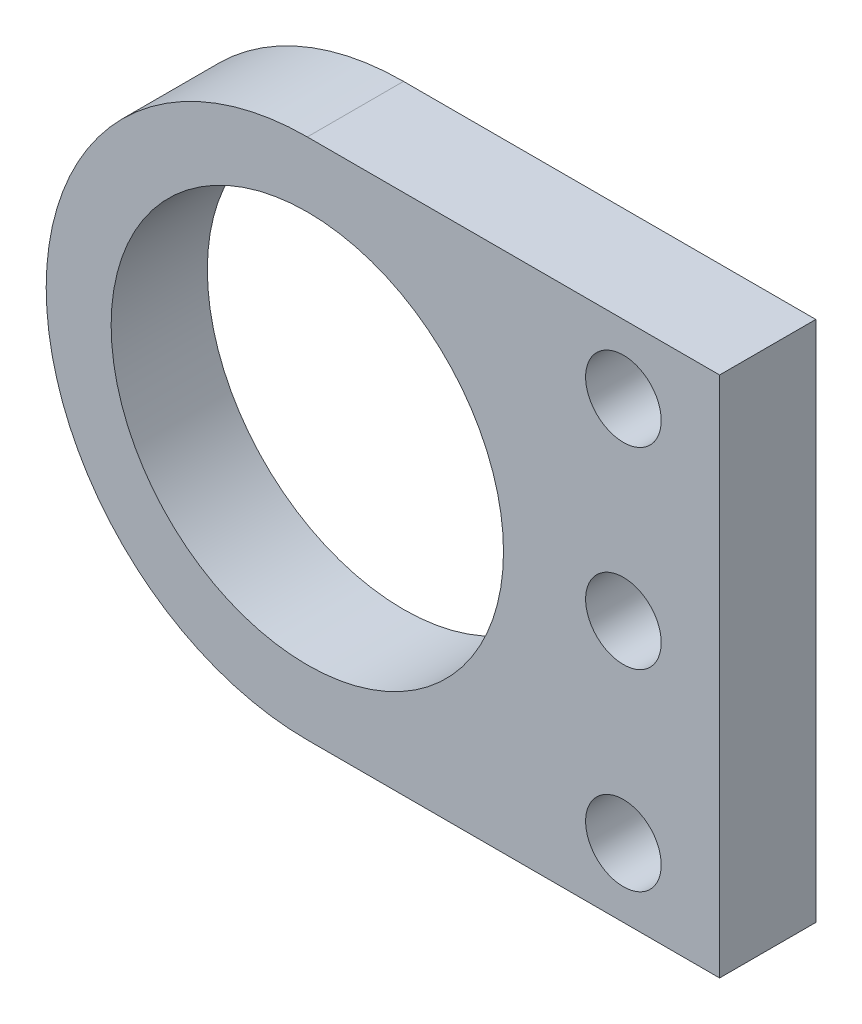
ISO-10303-21;
HEADER;
FILE_DESCRIPTION(('STEP AP214'),'2;1');
FILE_NAME('part.step','',(''),(''),'','','');
FILE_SCHEMA(('AUTOMOTIVE_DESIGN { 1 0 10303 214 1 1 1 1 }'));
ENDSEC;
DATA;
#1=APPLICATION_CONTEXT('core data for automotive mechanical design processes');
#2=APPLICATION_PROTOCOL_DEFINITION('international standard','automotive_design',2000,#1);
#3=PRODUCT_CONTEXT('',#1,'mechanical');
#4=PRODUCT('Part','Part','',(#3));
#5=PRODUCT_RELATED_PRODUCT_CATEGORY('part','',(#4));
#6=PRODUCT_DEFINITION_FORMATION('','',#4);
#7=PRODUCT_DEFINITION_CONTEXT('part definition',#1,'design');
#8=PRODUCT_DEFINITION('design','',#6,#7);
#9=PRODUCT_DEFINITION_SHAPE('','',#8);
#10=(LENGTH_UNIT() NAMED_UNIT(*) SI_UNIT(.MILLI.,.METRE.));
#11=(NAMED_UNIT(*) PLANE_ANGLE_UNIT() SI_UNIT($,.RADIAN.));
#12=(NAMED_UNIT(*) SI_UNIT($,.STERADIAN.) SOLID_ANGLE_UNIT());
#13=UNCERTAINTY_MEASURE_WITH_UNIT(LENGTH_MEASURE(1.E-05),#10,'distance_accuracy_value','');
#14=(GEOMETRIC_REPRESENTATION_CONTEXT(3) GLOBAL_UNCERTAINTY_ASSIGNED_CONTEXT((#13)) GLOBAL_UNIT_ASSIGNED_CONTEXT((#10,
#11,#12)) REPRESENTATION_CONTEXT('',''));
#15=CARTESIAN_POINT('',(0.,0.,0.));
#16=DIRECTION('',(0.,0.,1.));
#17=DIRECTION('',(1.,0.,0.));
#18=AXIS2_PLACEMENT_3D('',#15,#16,#17);
#19=CARTESIAN_POINT('',(0.,0.,7.));
#20=DIRECTION('',(0.,0.,-1.));
#21=DIRECTION('',(-1.,0.,0.));
#22=AXIS2_PLACEMENT_3D('',#19,#20,#21);
#23=PLANE('',#22);
#24=CARTESIAN_POINT('',(0.,0.,7.));
#25=DIRECTION('',(0.,0.,1.));
#26=DIRECTION('',(-1.,0.,0.));
#27=AXIS2_PLACEMENT_3D('',#24,#25,#26);
#28=CIRCLE('',#27,19.);
#29=CARTESIAN_POINT('',(0.,19.,7.));
#30=VERTEX_POINT('',#29);
#31=CARTESIAN_POINT('',(0.,-19.,7.));
#32=VERTEX_POINT('',#31);
#33=EDGE_CURVE('E93',#30,#32,#28,.T.);
#34=ORIENTED_EDGE('',*,*,#33,.T.);
#35=DIRECTION('',(1.,0.,0.));
#36=VECTOR('',#35,1.);
#37=CARTESIAN_POINT('',(0.,-19.,7.));
#38=LINE('',#37,#36);
#39=CARTESIAN_POINT('',(30.,-19.,7.));
#40=VERTEX_POINT('',#39);
#41=EDGE_CURVE('E88',#32,#40,#38,.T.);
#42=ORIENTED_EDGE('',*,*,#41,.T.);
#43=DIRECTION('',(0.,1.,0.));
#44=VECTOR('',#43,1.);
#45=CARTESIAN_POINT('',(30.,-19.,7.));
#46=LINE('',#45,#44);
#47=CARTESIAN_POINT('',(30.,19.,7.));
#48=VERTEX_POINT('',#47);
#49=EDGE_CURVE('E90',#40,#48,#46,.T.);
#50=ORIENTED_EDGE('',*,*,#49,.T.);
#51=DIRECTION('',(-1.,0.,0.));
#52=VECTOR('',#51,1.);
#53=CARTESIAN_POINT('',(30.,19.,7.));
#54=LINE('',#53,#52);
#55=EDGE_CURVE('E57',#48,#30,#54,.T.);
#56=ORIENTED_EDGE('',*,*,#55,.T.);
#57=EDGE_LOOP('',(#34,#42,#50,#56));
#58=FACE_BOUND('',#57,.T.);
#59=CARTESIAN_POINT('',(0.,0.,7.));
#60=DIRECTION('',(0.,0.,1.));
#61=DIRECTION('',(1.,0.,0.));
#62=AXIS2_PLACEMENT_3D('',#59,#60,#61);
#63=CIRCLE('',#62,14.275);
#64=CARTESIAN_POINT('',(14.275,0.,7.));
#65=VERTEX_POINT('',#64);
#66=EDGE_CURVE('E106',#65,#65,#63,.T.);
#67=ORIENTED_EDGE('',*,*,#66,.F.);
#68=EDGE_LOOP('',(#67));
#69=FACE_BOUND('',#68,.T.);
#70=CARTESIAN_POINT('',(23.,14.,7.));
#71=DIRECTION('',(0.,0.,1.));
#72=DIRECTION('',(1.,0.,0.));
#73=AXIS2_PLACEMENT_3D('',#70,#71,#72);
#74=CIRCLE('',#73,2.75);
#75=CARTESIAN_POINT('',(25.75,14.,7.));
#76=VERTEX_POINT('',#75);
#77=EDGE_CURVE('E121',#76,#76,#74,.T.);
#78=ORIENTED_EDGE('',*,*,#77,.F.);
#79=EDGE_LOOP('',(#78));
#80=FACE_BOUND('',#79,.T.);
#81=CARTESIAN_POINT('',(23.,0.,7.));
#82=DIRECTION('',(0.,0.,1.));
#83=DIRECTION('',(1.,0.,0.));
#84=AXIS2_PLACEMENT_3D('',#81,#82,#83);
#85=CIRCLE('',#84,2.75);
#86=CARTESIAN_POINT('',(25.75,0.,7.));
#87=VERTEX_POINT('',#86);
#88=EDGE_CURVE('E130',#87,#87,#85,.T.);
#89=ORIENTED_EDGE('',*,*,#88,.F.);
#90=EDGE_LOOP('',(#89));
#91=FACE_BOUND('',#90,.T.);
#92=CARTESIAN_POINT('',(23.,-14.,7.));
#93=DIRECTION('',(0.,0.,1.));
#94=DIRECTION('',(1.,0.,0.));
#95=AXIS2_PLACEMENT_3D('',#92,#93,#94);
#96=CIRCLE('',#95,2.75);
#97=CARTESIAN_POINT('',(25.75,-14.,7.));
#98=VERTEX_POINT('',#97);
#99=EDGE_CURVE('E134',#98,#98,#96,.T.);
#100=ORIENTED_EDGE('',*,*,#99,.F.);
#101=EDGE_LOOP('',(#100));
#102=FACE_BOUND('',#101,.T.);
#103=ADVANCED_FACE('F39',(#58,#69,#80,#91,#102),#23,.F.);
#104=CARTESIAN_POINT('',(0.,0.,0.));
#105=DIRECTION('',(0.,0.,-1.));
#106=DIRECTION('',(-1.,0.,0.));
#107=AXIS2_PLACEMENT_3D('',#104,#105,#106);
#108=PLANE('',#107);
#109=CARTESIAN_POINT('',(23.,0.,0.));
#110=DIRECTION('',(0.,0.,1.));
#111=DIRECTION('',(1.,0.,0.));
#112=AXIS2_PLACEMENT_3D('',#109,#110,#111);
#113=CIRCLE('',#112,2.75);
#114=CARTESIAN_POINT('',(25.75,0.,0.));
#115=VERTEX_POINT('',#114);
#116=EDGE_CURVE('E128',#115,#115,#113,.T.);
#117=ORIENTED_EDGE('',*,*,#116,.T.);
#118=EDGE_LOOP('',(#117));
#119=FACE_BOUND('',#118,.T.);
#120=CARTESIAN_POINT('',(0.,0.,0.));
#121=DIRECTION('',(0.,0.,1.));
#122=DIRECTION('',(1.,0.,0.));
#123=AXIS2_PLACEMENT_3D('',#120,#121,#122);
#124=CIRCLE('',#123,14.275);
#125=CARTESIAN_POINT('',(14.275,0.,0.));
#126=VERTEX_POINT('',#125);
#127=EDGE_CURVE('E119',#126,#126,#124,.T.);
#128=ORIENTED_EDGE('',*,*,#127,.T.);
#129=EDGE_LOOP('',(#128));
#130=FACE_BOUND('',#129,.T.);
#131=CARTESIAN_POINT('',(0.,0.,0.));
#132=DIRECTION('',(0.,0.,1.));
#133=DIRECTION('',(-1.,0.,0.));
#134=AXIS2_PLACEMENT_3D('',#131,#132,#133);
#135=CIRCLE('',#134,19.);
#136=CARTESIAN_POINT('',(0.,19.,0.));
#137=VERTEX_POINT('',#136);
#138=CARTESIAN_POINT('',(0.,-19.,0.));
#139=VERTEX_POINT('',#138);
#140=EDGE_CURVE('E103',#137,#139,#135,.T.);
#141=ORIENTED_EDGE('',*,*,#140,.F.);
#142=DIRECTION('',(-1.,0.,0.));
#143=VECTOR('',#142,1.);
#144=CARTESIAN_POINT('',(30.,19.,0.));
#145=LINE('',#144,#143);
#146=CARTESIAN_POINT('',(30.,19.,0.));
#147=VERTEX_POINT('',#146);
#148=EDGE_CURVE('E76',#147,#137,#145,.T.);
#149=ORIENTED_EDGE('',*,*,#148,.F.);
#150=DIRECTION('',(0.,1.,0.));
#151=VECTOR('',#150,1.);
#152=CARTESIAN_POINT('',(30.,-19.,0.));
#153=LINE('',#152,#151);
#154=CARTESIAN_POINT('',(30.,-19.,0.));
#155=VERTEX_POINT('',#154);
#156=EDGE_CURVE('E71',#155,#147,#153,.T.);
#157=ORIENTED_EDGE('',*,*,#156,.F.);
#158=DIRECTION('',(1.,0.,0.));
#159=VECTOR('',#158,1.);
#160=CARTESIAN_POINT('',(0.,-19.,0.));
#161=LINE('',#160,#159);
#162=EDGE_CURVE('E92',#139,#155,#161,.T.);
#163=ORIENTED_EDGE('',*,*,#162,.F.);
#164=EDGE_LOOP('',(#141,#149,#157,#163));
#165=FACE_BOUND('',#164,.T.);
#166=CARTESIAN_POINT('',(23.,14.,0.));
#167=DIRECTION('',(0.,0.,1.));
#168=DIRECTION('',(1.,0.,0.));
#169=AXIS2_PLACEMENT_3D('',#166,#167,#168);
#170=CIRCLE('',#169,2.75);
#171=CARTESIAN_POINT('',(25.75,14.,0.));
#172=VERTEX_POINT('',#171);
#173=EDGE_CURVE('E123',#172,#172,#170,.T.);
#174=ORIENTED_EDGE('',*,*,#173,.T.);
#175=EDGE_LOOP('',(#174));
#176=FACE_BOUND('',#175,.T.);
#177=CARTESIAN_POINT('',(23.,-14.,0.));
#178=DIRECTION('',(0.,0.,1.));
#179=DIRECTION('',(1.,0.,0.));
#180=AXIS2_PLACEMENT_3D('',#177,#178,#179);
#181=CIRCLE('',#180,2.75);
#182=CARTESIAN_POINT('',(25.75,-14.,0.));
#183=VERTEX_POINT('',#182);
#184=EDGE_CURVE('E136',#183,#183,#181,.T.);
#185=ORIENTED_EDGE('',*,*,#184,.T.);
#186=EDGE_LOOP('',(#185));
#187=FACE_BOUND('',#186,.T.);
#188=ADVANCED_FACE('F111',(#119,#130,#165,#176,#187),#108,.T.);
#189=CARTESIAN_POINT('',(0.,0.,7.));
#190=DIRECTION('',(0.,0.,-1.));
#191=DIRECTION('',(-1.,0.,0.));
#192=AXIS2_PLACEMENT_3D('',#189,#190,#191);
#193=CYLINDRICAL_SURFACE('',#192,19.);
#194=ORIENTED_EDGE('',*,*,#140,.T.);
#195=DIRECTION('',(0.,0.,-1.));
#196=VECTOR('',#195,1.);
#197=CARTESIAN_POINT('',(0.,-19.,7.));
#198=LINE('',#197,#196);
#199=EDGE_CURVE('E11',#32,#139,#198,.T.);
#200=ORIENTED_EDGE('',*,*,#199,.F.);
#201=ORIENTED_EDGE('',*,*,#33,.F.);
#202=DIRECTION('',(0.,0.,-1.));
#203=VECTOR('',#202,1.);
#204=CARTESIAN_POINT('',(0.,19.,7.));
#205=LINE('',#204,#203);
#206=EDGE_CURVE('E97',#30,#137,#205,.T.);
#207=ORIENTED_EDGE('',*,*,#206,.T.);
#208=EDGE_LOOP('',(#194,#200,#201,#207));
#209=FACE_BOUND('',#208,.T.);
#210=ADVANCED_FACE('F41',(#209),#193,.T.);
#211=CARTESIAN_POINT('',(0.,-19.,7.));
#212=DIRECTION('',(0.,1.,0.));
#213=DIRECTION('',(-1.,0.,0.));
#214=AXIS2_PLACEMENT_3D('',#211,#212,#213);
#215=PLANE('',#214);
#216=ORIENTED_EDGE('',*,*,#162,.T.);
#217=DIRECTION('',(0.,0.,-1.));
#218=VECTOR('',#217,1.);
#219=CARTESIAN_POINT('',(30.,-19.,7.));
#220=LINE('',#219,#218);
#221=EDGE_CURVE('E48',#40,#155,#220,.T.);
#222=ORIENTED_EDGE('',*,*,#221,.F.);
#223=ORIENTED_EDGE('',*,*,#41,.F.);
#224=ORIENTED_EDGE('',*,*,#199,.T.);
#225=EDGE_LOOP('',(#216,#222,#223,#224));
#226=FACE_BOUND('',#225,.T.);
#227=ADVANCED_FACE('F94',(#226),#215,.F.);
#228=CARTESIAN_POINT('',(30.,-19.,7.));
#229=DIRECTION('',(-1.,0.,0.));
#230=DIRECTION('',(0.,0.,1.));
#231=AXIS2_PLACEMENT_3D('',#228,#229,#230);
#232=PLANE('',#231);
#233=ORIENTED_EDGE('',*,*,#156,.T.);
#234=DIRECTION('',(0.,0.,-1.));
#235=VECTOR('',#234,1.);
#236=CARTESIAN_POINT('',(30.,19.,7.));
#237=LINE('',#236,#235);
#238=EDGE_CURVE('E96',#48,#147,#237,.T.);
#239=ORIENTED_EDGE('',*,*,#238,.F.);
#240=ORIENTED_EDGE('',*,*,#49,.F.);
#241=ORIENTED_EDGE('',*,*,#221,.T.);
#242=EDGE_LOOP('',(#233,#239,#240,#241));
#243=FACE_BOUND('',#242,.T.);
#244=ADVANCED_FACE('F100',(#243),#232,.F.);
#245=CARTESIAN_POINT('',(30.,19.,7.));
#246=DIRECTION('',(0.,-1.,0.));
#247=DIRECTION('',(0.,0.,-1.));
#248=AXIS2_PLACEMENT_3D('',#245,#246,#247);
#249=PLANE('',#248);
#250=ORIENTED_EDGE('',*,*,#148,.T.);
#251=ORIENTED_EDGE('',*,*,#206,.F.);
#252=ORIENTED_EDGE('',*,*,#55,.F.);
#253=ORIENTED_EDGE('',*,*,#238,.T.);
#254=EDGE_LOOP('',(#250,#251,#252,#253));
#255=FACE_BOUND('',#254,.T.);
#256=ADVANCED_FACE('F112',(#255),#249,.F.);
#257=CARTESIAN_POINT('',(0.,0.,7.));
#258=DIRECTION('',(0.,0.,-1.));
#259=DIRECTION('',(-1.,0.,0.));
#260=AXIS2_PLACEMENT_3D('',#257,#258,#259);
#261=CYLINDRICAL_SURFACE('',#260,14.275);
#262=ORIENTED_EDGE('',*,*,#66,.T.);
#263=EDGE_LOOP('',(#262));
#264=FACE_BOUND('',#263,.T.);
#265=ORIENTED_EDGE('',*,*,#127,.F.);
#266=EDGE_LOOP('',(#265));
#267=FACE_BOUND('',#266,.T.);
#268=ADVANCED_FACE('F153',(#264,#267),#261,.F.);
#269=CARTESIAN_POINT('',(23.,14.,7.));
#270=DIRECTION('',(0.,0.,-1.));
#271=DIRECTION('',(-1.,0.,0.));
#272=AXIS2_PLACEMENT_3D('',#269,#270,#271);
#273=CYLINDRICAL_SURFACE('',#272,2.75);
#274=ORIENTED_EDGE('',*,*,#77,.T.);
#275=EDGE_LOOP('',(#274));
#276=FACE_BOUND('',#275,.T.);
#277=ORIENTED_EDGE('',*,*,#173,.F.);
#278=EDGE_LOOP('',(#277));
#279=FACE_BOUND('',#278,.T.);
#280=ADVANCED_FACE('F196',(#276,#279),#273,.F.);
#281=CARTESIAN_POINT('',(23.,0.,7.));
#282=DIRECTION('',(0.,0.,-1.));
#283=DIRECTION('',(-1.,0.,0.));
#284=AXIS2_PLACEMENT_3D('',#281,#282,#283);
#285=CYLINDRICAL_SURFACE('',#284,2.75);
#286=ORIENTED_EDGE('',*,*,#88,.T.);
#287=EDGE_LOOP('',(#286));
#288=FACE_BOUND('',#287,.T.);
#289=ORIENTED_EDGE('',*,*,#116,.F.);
#290=EDGE_LOOP('',(#289));
#291=FACE_BOUND('',#290,.T.);
#292=ADVANCED_FACE('F206',(#288,#291),#285,.F.);
#293=CARTESIAN_POINT('',(23.,-14.,7.));
#294=DIRECTION('',(0.,0.,-1.));
#295=DIRECTION('',(-1.,0.,0.));
#296=AXIS2_PLACEMENT_3D('',#293,#294,#295);
#297=CYLINDRICAL_SURFACE('',#296,2.75);
#298=ORIENTED_EDGE('',*,*,#99,.T.);
#299=EDGE_LOOP('',(#298));
#300=FACE_BOUND('',#299,.T.);
#301=ORIENTED_EDGE('',*,*,#184,.F.);
#302=EDGE_LOOP('',(#301));
#303=FACE_BOUND('',#302,.T.);
#304=ADVANCED_FACE('F142',(#300,#303),#297,.F.);
#305=CLOSED_SHELL('',(#103,#188,#210,#227,#244,#256,#268,#280,#292,#304));
#306=MANIFOLD_SOLID_BREP('B2',#305);
#307=ADVANCED_BREP_SHAPE_REPRESENTATION('',(#18,#306),#14);
#308=SHAPE_DEFINITION_REPRESENTATION(#9,#307);
ENDSEC;
END-ISO-10303-21;
